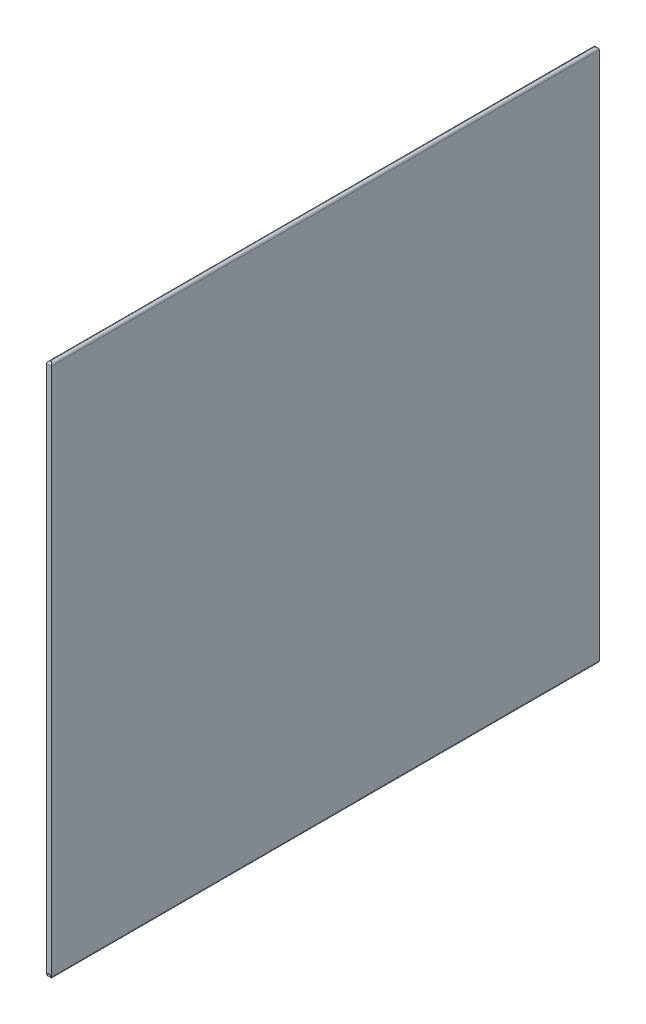
ISO-10303-21;
HEADER;
FILE_DESCRIPTION(('STEP AP214'),'2;1');
FILE_NAME('part.step','',(''),(''),'','','');
FILE_SCHEMA(('AUTOMOTIVE_DESIGN { 1 0 10303 214 1 1 1 1 }'));
ENDSEC;
DATA;
#1=APPLICATION_CONTEXT('core data for automotive mechanical design processes');
#2=APPLICATION_PROTOCOL_DEFINITION('international standard','automotive_design',2000,#1);
#3=PRODUCT_CONTEXT('',#1,'mechanical');
#4=PRODUCT('Part','Part','',(#3));
#5=PRODUCT_RELATED_PRODUCT_CATEGORY('part','',(#4));
#6=PRODUCT_DEFINITION_FORMATION('','',#4);
#7=PRODUCT_DEFINITION_CONTEXT('part definition',#1,'design');
#8=PRODUCT_DEFINITION('design','',#6,#7);
#9=PRODUCT_DEFINITION_SHAPE('','',#8);
#10=(LENGTH_UNIT() NAMED_UNIT(*) SI_UNIT(.MILLI.,.METRE.));
#11=(NAMED_UNIT(*) PLANE_ANGLE_UNIT() SI_UNIT($,.RADIAN.));
#12=(NAMED_UNIT(*) SI_UNIT($,.STERADIAN.) SOLID_ANGLE_UNIT());
#13=UNCERTAINTY_MEASURE_WITH_UNIT(LENGTH_MEASURE(1.E-05),#10,'distance_accuracy_value','');
#14=(GEOMETRIC_REPRESENTATION_CONTEXT(3) GLOBAL_UNCERTAINTY_ASSIGNED_CONTEXT((#13)) GLOBAL_UNIT_ASSIGNED_CONTEXT((#10,
#11,#12)) REPRESENTATION_CONTEXT('',''));
#15=CARTESIAN_POINT('',(0.,0.,0.));
#16=DIRECTION('',(0.,0.,1.));
#17=DIRECTION('',(1.,0.,0.));
#18=AXIS2_PLACEMENT_3D('',#15,#16,#17);
#19=CARTESIAN_POINT('',(3.,167.,-171.5));
#20=DIRECTION('',(0.,0.,1.));
#21=DIRECTION('',(0.,-1.,0.));
#22=AXIS2_PLACEMENT_3D('',#19,#20,#21);
#23=PLANE('',#22);
#24=DIRECTION('',(0.,1.,0.));
#25=VECTOR('',#24,1.);
#26=CARTESIAN_POINT('',(0.,167.,-171.5));
#27=LINE('',#26,#25);
#28=CARTESIAN_POINT('',(0.,-165.5,-171.5));
#29=VERTEX_POINT('',#28);
#30=CARTESIAN_POINT('',(0.,165.5,-171.5));
#31=VERTEX_POINT('',#30);
#32=EDGE_CURVE('E95',#29,#31,#27,.T.);
#33=ORIENTED_EDGE('',*,*,#32,.T.);
#34=DIRECTION('',(-1.,0.,0.));
#35=VECTOR('',#34,1.);
#36=CARTESIAN_POINT('',(3.,165.5,-171.5));
#37=LINE('',#36,#35);
#38=CARTESIAN_POINT('',(3.,165.5,-171.5));
#39=VERTEX_POINT('',#38);
#40=EDGE_CURVE('E103',#31,#39,#37,.F.);
#41=ORIENTED_EDGE('',*,*,#40,.T.);
#42=DIRECTION('',(0.,1.,0.));
#43=VECTOR('',#42,1.);
#44=CARTESIAN_POINT('',(3.,167.,-171.5));
#45=LINE('',#44,#43);
#46=CARTESIAN_POINT('',(3.,-165.5,-171.5));
#47=VERTEX_POINT('',#46);
#48=EDGE_CURVE('E151',#47,#39,#45,.T.);
#49=ORIENTED_EDGE('',*,*,#48,.F.);
#50=DIRECTION('',(-1.,0.,0.));
#51=VECTOR('',#50,1.);
#52=CARTESIAN_POINT('',(3.,-165.5,-171.5));
#53=LINE('',#52,#51);
#54=CARTESIAN_POINT('',(2.5,-165.5,-171.5));
#55=VERTEX_POINT('',#54);
#56=EDGE_CURVE('E317',#47,#55,#53,.T.);
#57=ORIENTED_EDGE('',*,*,#56,.T.);
#58=CARTESIAN_POINT('',(1.5,-165.5,-171.5));
#59=DIRECTION('',(0.,0.,1.));
#60=DIRECTION('',(1.,0.,0.));
#61=AXIS2_PLACEMENT_3D('',#58,#59,#60);
#62=CIRCLE('',#61,1.);
#63=CARTESIAN_POINT('',(0.5,-165.5,-171.5));
#64=VERTEX_POINT('',#63);
#65=EDGE_CURVE('E108',#55,#64,#62,.T.);
#66=ORIENTED_EDGE('',*,*,#65,.T.);
#67=DIRECTION('',(-1.,0.,0.));
#68=VECTOR('',#67,1.);
#69=CARTESIAN_POINT('',(3.,-165.5,-171.5));
#70=LINE('',#69,#68);
#71=EDGE_CURVE('E107',#64,#29,#70,.T.);
#72=ORIENTED_EDGE('',*,*,#71,.T.);
#73=EDGE_LOOP('',(#33,#41,#49,#57,#66,#72));
#74=FACE_BOUND('',#73,.T.);
#75=ADVANCED_FACE('F34',(#74),#23,.F.);
#76=CARTESIAN_POINT('',(3.,167.,171.5));
#77=DIRECTION('',(0.,0.,-1.));
#78=DIRECTION('',(0.,1.,0.));
#79=AXIS2_PLACEMENT_3D('',#76,#77,#78);
#80=PLANE('',#79);
#81=DIRECTION('',(0.,-1.,0.));
#82=VECTOR('',#81,1.);
#83=CARTESIAN_POINT('',(3.,167.,171.5));
#84=LINE('',#83,#82);
#85=CARTESIAN_POINT('',(3.,165.5,171.5));
#86=VERTEX_POINT('',#85);
#87=CARTESIAN_POINT('',(3.,-165.5,171.5));
#88=VERTEX_POINT('',#87);
#89=EDGE_CURVE('E149',#86,#88,#84,.T.);
#90=ORIENTED_EDGE('',*,*,#89,.F.);
#91=DIRECTION('',(-1.,0.,0.));
#92=VECTOR('',#91,1.);
#93=CARTESIAN_POINT('',(3.,165.5,171.5));
#94=LINE('',#93,#92);
#95=CARTESIAN_POINT('',(0.,165.5,171.5));
#96=VERTEX_POINT('',#95);
#97=EDGE_CURVE('E44',#86,#96,#94,.T.);
#98=ORIENTED_EDGE('',*,*,#97,.T.);
#99=DIRECTION('',(0.,-1.,0.));
#100=VECTOR('',#99,1.);
#101=CARTESIAN_POINT('',(0.,167.,171.5));
#102=LINE('',#101,#100);
#103=CARTESIAN_POINT('',(0.,-165.5,171.5));
#104=VERTEX_POINT('',#103);
#105=EDGE_CURVE('E97',#96,#104,#102,.T.);
#106=ORIENTED_EDGE('',*,*,#105,.T.);
#107=DIRECTION('',(-1.,0.,0.));
#108=VECTOR('',#107,1.);
#109=CARTESIAN_POINT('',(3.,-165.5,171.5));
#110=LINE('',#109,#108);
#111=CARTESIAN_POINT('',(0.5,-165.5,171.5));
#112=VERTEX_POINT('',#111);
#113=EDGE_CURVE('E310',#104,#112,#110,.F.);
#114=ORIENTED_EDGE('',*,*,#113,.T.);
#115=CARTESIAN_POINT('',(1.5,-165.5,171.5));
#116=DIRECTION('',(0.,0.,1.));
#117=DIRECTION('',(1.,0.,0.));
#118=AXIS2_PLACEMENT_3D('',#115,#116,#117);
#119=CIRCLE('',#118,1.);
#120=CARTESIAN_POINT('',(2.5,-165.5,171.5));
#121=VERTEX_POINT('',#120);
#122=EDGE_CURVE('E142',#121,#112,#119,.T.);
#123=ORIENTED_EDGE('',*,*,#122,.F.);
#124=DIRECTION('',(-1.,0.,0.));
#125=VECTOR('',#124,1.);
#126=CARTESIAN_POINT('',(3.,-165.5,171.5));
#127=LINE('',#126,#125);
#128=EDGE_CURVE('E155',#121,#88,#127,.F.);
#129=ORIENTED_EDGE('',*,*,#128,.T.);
#130=EDGE_LOOP('',(#90,#98,#106,#114,#123,#129));
#131=FACE_BOUND('',#130,.T.);
#132=ADVANCED_FACE('F152',(#131),#80,.F.);
#133=CARTESIAN_POINT('',(3.,-167.,-171.5));
#134=DIRECTION('',(1.,0.,0.));
#135=DIRECTION('',(0.,0.,-1.));
#136=AXIS2_PLACEMENT_3D('',#133,#134,#135);
#137=PLANE('',#136);
#138=ORIENTED_EDGE('',*,*,#48,.T.);
#139=DIRECTION('',(0.,0.,1.));
#140=VECTOR('',#139,1.);
#141=CARTESIAN_POINT('',(3.,165.5,171.5));
#142=LINE('',#141,#140);
#143=EDGE_CURVE('E116',#39,#86,#142,.T.);
#144=ORIENTED_EDGE('',*,*,#143,.T.);
#145=ORIENTED_EDGE('',*,*,#89,.T.);
#146=DIRECTION('',(0.,0.,-1.));
#147=VECTOR('',#146,1.);
#148=CARTESIAN_POINT('',(3.,-165.5,-171.5));
#149=LINE('',#148,#147);
#150=EDGE_CURVE('E186',#88,#47,#149,.T.);
#151=ORIENTED_EDGE('',*,*,#150,.T.);
#152=EDGE_LOOP('',(#138,#144,#145,#151));
#153=FACE_BOUND('',#152,.T.);
#154=ADVANCED_FACE('F146',(#153),#137,.T.);
#155=CARTESIAN_POINT('',(0.,-167.,-171.5));
#156=DIRECTION('',(1.,0.,0.));
#157=DIRECTION('',(0.,0.,-1.));
#158=AXIS2_PLACEMENT_3D('',#155,#156,#157);
#159=PLANE('',#158);
#160=ORIENTED_EDGE('',*,*,#105,.F.);
#161=DIRECTION('',(0.,0.,1.));
#162=VECTOR('',#161,1.);
#163=CARTESIAN_POINT('',(0.,165.5,-171.5));
#164=LINE('',#163,#162);
#165=EDGE_CURVE('E11',#96,#31,#164,.F.);
#166=ORIENTED_EDGE('',*,*,#165,.T.);
#167=ORIENTED_EDGE('',*,*,#32,.F.);
#168=DIRECTION('',(0.,0.,-1.));
#169=VECTOR('',#168,1.);
#170=CARTESIAN_POINT('',(0.,-165.5,-171.5));
#171=LINE('',#170,#169);
#172=EDGE_CURVE('E117',#29,#104,#171,.F.);
#173=ORIENTED_EDGE('',*,*,#172,.T.);
#174=EDGE_LOOP('',(#160,#166,#167,#173));
#175=FACE_BOUND('',#174,.T.);
#176=ADVANCED_FACE('F93',(#175),#159,.F.);
#177=CARTESIAN_POINT('',(1.5,-165.5,-171.5));
#178=DIRECTION('',(0.,0.,1.));
#179=DIRECTION('',(1.,0.,0.));
#180=AXIS2_PLACEMENT_3D('',#177,#178,#179);
#181=CYLINDRICAL_SURFACE('',#180,1.);
#182=ORIENTED_EDGE('',*,*,#65,.F.);
#183=CARTESIAN_POINT('',(2.5,-165.5,-171.5));
#184=CARTESIAN_POINT('',(2.50000213248189,-165.525222990855,-171.500003070334));
#185=CARTESIAN_POINT('',(2.49904499371486,-165.550431776475,-171.499363152648));
#186=CARTESIAN_POINT('',(2.49524199874773,-165.600629112911,-171.496831201766));
#187=CARTESIAN_POINT('',(2.4923972154442,-165.625617780667,-171.494939879844));
#188=CARTESIAN_POINT('',(2.48112709883325,-165.699663245567,-171.48747331579));
#189=CARTESIAN_POINT('',(2.4699650315194,-165.748156182402,-171.480104466037));
#190=CARTESIAN_POINT('',(2.44095418700605,-165.842087599947,-171.461257846778));
#191=CARTESIAN_POINT('',(2.42311782994395,-165.887531570356,-171.449787711075));
#192=CARTESIAN_POINT('',(2.38149564691459,-165.974657625672,-171.423647481404));
#193=CARTESIAN_POINT('',(2.35770218136297,-166.016334785768,-171.408973281556));
#194=CARTESIAN_POINT('',(2.30266965775545,-166.098645812887,-171.3761355465));
#195=CARTESIAN_POINT('',(2.27097200165984,-166.138895498828,-171.35778213569));
#196=CARTESIAN_POINT('',(2.20213023620311,-166.213868266687,-171.319909073444));
#197=CARTESIAN_POINT('',(2.16497900858315,-166.248583999983,-171.30038791785));
#198=CARTESIAN_POINT('',(2.07947349446955,-166.317111807446,-171.258641166792));
#199=CARTESIAN_POINT('',(2.03027648073668,-166.349916409879,-171.236475027298));
#200=CARTESIAN_POINT('',(1.9258175326236,-166.40675210789,-171.195420470658));
#201=CARTESIAN_POINT('',(1.87056639195628,-166.430798497502,-171.176526370281));
#202=CARTESIAN_POINT('',(1.77164456216695,-166.463370108933,-171.149881389324));
#203=CARTESIAN_POINT('',(1.72923620443698,-166.47437212537,-171.140488234465));
#204=CARTESIAN_POINT('',(1.64262819626992,-166.490753033265,-171.126289897628));
#205=CARTESIAN_POINT('',(1.59843175121121,-166.49614156076,-171.121476854726));
#206=CARTESIAN_POINT('',(1.50926261471987,-166.500956820802,-171.117183028096));
#207=CARTESIAN_POINT('',(1.46428749714002,-166.500359214949,-171.117724012648));
#208=CARTESIAN_POINT('',(1.3751825221893,-166.49318790774,-171.124098876286));
#209=CARTESIAN_POINT('',(1.33105341345558,-166.486609142232,-171.12993724057));
#210=CARTESIAN_POINT('',(1.24676627768333,-166.468324929029,-171.145635966616));
#211=CARTESIAN_POINT('',(1.20651894747408,-166.456858450018,-171.155307534178));
#212=CARTESIAN_POINT('',(1.12848779270318,-166.429350437143,-171.177548234967));
#213=CARTESIAN_POINT('',(1.09070476004808,-166.413307441421,-171.190118293802));
#214=CARTESIAN_POINT('',(1.01048753786344,-166.373369220774,-171.219820894925));
#215=CARTESIAN_POINT('',(0.96867050096613,-166.348540569392,-171.237361400579));
#216=CARTESIAN_POINT('',(0.889308701198348,-166.293345085664,-171.273457490993));
#217=CARTESIAN_POINT('',(0.851769348144859,-166.262971364212,-171.292014318113));
#218=CARTESIAN_POINT('',(0.773731920925005,-166.18990899484,-171.332715056892));
#219=CARTESIAN_POINT('',(0.734338884622625,-166.14597700278,-171.354770433332));
#220=CARTESIAN_POINT('',(0.663406423713538,-166.051010849238,-171.396087632438));
#221=CARTESIAN_POINT('',(0.631860807189989,-165.999982337071,-171.415351652548));
#222=CARTESIAN_POINT('',(0.583246943501984,-165.902402495506,-171.445735942707));
#223=CARTESIAN_POINT('',(0.564554000713006,-165.856926569714,-171.45771205485));
#224=CARTESIAN_POINT('',(0.533931258474159,-165.762945787397,-171.477549146516));
#225=CARTESIAN_POINT('',(0.521986900799653,-165.714447703419,-171.485418981378));
#226=CARTESIAN_POINT('',(0.509176214174973,-165.637947419418,-171.493894598437));
#227=CARTESIAN_POINT('',(0.505743657680969,-165.610532328099,-171.496175478036));
#228=CARTESIAN_POINT('',(0.501153051464654,-165.555417283018,-171.499231127029));
#229=CARTESIAN_POINT('',(0.499996031208196,-165.527717206022,-171.50000521474));
#230=CARTESIAN_POINT('',(0.5,-165.5,-171.5));
#231=B_SPLINE_CURVE_WITH_KNOTS('',3,(#183,#184,#185,#186,#187,#188,#189,#190,#191,#192,#193,
#194,#195,#196,#197,#198,#199,#200,#201,#202,#203,#204,#205,#206,#207,#208,#209,#210,#211,#212,
#213,#214,#215,#216,#217,#218,#219,#220,#221,#222,#223,#224,#225,#226,#227,#228,#229,#230),
.UNSPECIFIED.,.F.,.F.,(4,2,2,2,2,2,2,2,2,2,2,2,2,2,2,2,2,2,2,2,2,2,2,4),(0.,0.0756155393796863,
0.151188137283899,0.301278773145161,0.451091484295527,0.601097313024787,0.763749621108001,
0.92661615014031,1.11518883123062,1.30343062019747,1.43732188431412,1.57098293189719,
1.7051876379853,1.83950607898824,1.96789901619187,2.09633301145898,2.25089113961453,
2.40564261145954,2.59373489293892,2.7816782882283,2.93287425225033,3.08374279470931,
3.16678966855171,3.24987410464917),.UNSPECIFIED.);
#232=EDGE_CURVE('E187',#55,#64,#231,.T.);
#233=ORIENTED_EDGE('',*,*,#232,.T.);
#234=EDGE_LOOP('',(#182,#233));
#235=FACE_BOUND('',#234,.T.);
#236=ORIENTED_EDGE('',*,*,#122,.T.);
#237=CARTESIAN_POINT('',(0.5,-165.5,171.5));
#238=CARTESIAN_POINT('',(0.499997867518114,-165.525222990855,171.500003070334));
#239=CARTESIAN_POINT('',(0.500955006285137,-165.550431776475,171.499363152648));
#240=CARTESIAN_POINT('',(0.504758001252271,-165.600629112911,171.496831201766));
#241=CARTESIAN_POINT('',(0.507602784555795,-165.625617780667,171.494939879844));
#242=CARTESIAN_POINT('',(0.518872901166755,-165.699663245567,171.48747331579));
#243=CARTESIAN_POINT('',(0.530034968480598,-165.748156182402,171.480104466037));
#244=CARTESIAN_POINT('',(0.559045812993951,-165.842087599947,171.461257846777));
#245=CARTESIAN_POINT('',(0.576882170056055,-165.887531570356,171.449787711075));
#246=CARTESIAN_POINT('',(0.618504353085416,-165.974657625672,171.423647481404));
#247=CARTESIAN_POINT('',(0.642297818637035,-166.016334785768,171.408973281555));
#248=CARTESIAN_POINT('',(0.697330342244554,-166.098645812887,171.3761355465));
#249=CARTESIAN_POINT('',(0.729027998340174,-166.138895498828,171.35778213569));
#250=CARTESIAN_POINT('',(0.797869763796898,-166.213868266687,171.319909073444));
#251=CARTESIAN_POINT('',(0.835020991416855,-166.248583999983,171.30038791785));
#252=CARTESIAN_POINT('',(0.920526505530444,-166.317111807446,171.258641166792));
#253=CARTESIAN_POINT('',(0.969723519263316,-166.349916409879,171.236475027298));
#254=CARTESIAN_POINT('',(1.0741824673764,-166.40675210789,171.195420470658));
#255=CARTESIAN_POINT('',(1.12943360804372,-166.430798497502,171.17652637028));
#256=CARTESIAN_POINT('',(1.22835543783305,-166.463370108933,171.149881389324));
#257=CARTESIAN_POINT('',(1.27076379556302,-166.47437212537,171.140488234465));
#258=CARTESIAN_POINT('',(1.35737180373009,-166.490753033265,171.126289897628));
#259=CARTESIAN_POINT('',(1.40156824878879,-166.49614156076,171.121476854726));
#260=CARTESIAN_POINT('',(1.49073738528013,-166.500956820802,171.117183028096));
#261=CARTESIAN_POINT('',(1.53571250285998,-166.500359214949,171.117724012648));
#262=CARTESIAN_POINT('',(1.6248174778107,-166.49318790774,171.124098876286));
#263=CARTESIAN_POINT('',(1.66894658654442,-166.486609142232,171.12993724057));
#264=CARTESIAN_POINT('',(1.75323372231667,-166.468324929029,171.145635966616));
#265=CARTESIAN_POINT('',(1.79348105252592,-166.456858450018,171.155307534177));
#266=CARTESIAN_POINT('',(1.87151220729682,-166.429350437143,171.177548234967));
#267=CARTESIAN_POINT('',(1.90929523995193,-166.413307441421,171.190118293802));
#268=CARTESIAN_POINT('',(1.98951246213657,-166.373369220774,171.219820894925));
#269=CARTESIAN_POINT('',(2.03132949903387,-166.348540569392,171.237361400579));
#270=CARTESIAN_POINT('',(2.11069129880165,-166.293345085664,171.273457490993));
#271=CARTESIAN_POINT('',(2.14823065185514,-166.262971364212,171.292014318113));
#272=CARTESIAN_POINT('',(2.226268079075,-166.18990899484,171.332715056892));
#273=CARTESIAN_POINT('',(2.26566111537738,-166.14597700278,171.354770433332));
#274=CARTESIAN_POINT('',(2.33659357628646,-166.051010849238,171.396087632438));
#275=CARTESIAN_POINT('',(2.36813919281001,-165.999982337071,171.415351652548));
#276=CARTESIAN_POINT('',(2.41675305649801,-165.902402495506,171.445735942706));
#277=CARTESIAN_POINT('',(2.43544599928699,-165.856926569715,171.45771205485));
#278=CARTESIAN_POINT('',(2.46606874152584,-165.762945787397,171.477549146516));
#279=CARTESIAN_POINT('',(2.47801309920035,-165.714447703419,171.485418981378));
#280=CARTESIAN_POINT('',(2.49082378582503,-165.637947419418,171.493894598437));
#281=CARTESIAN_POINT('',(2.49425634231903,-165.610532328099,171.496175478036));
#282=CARTESIAN_POINT('',(2.49884694853535,-165.555417283018,171.499231127029));
#283=CARTESIAN_POINT('',(2.5000039687918,-165.527717206022,171.50000521474));
#284=CARTESIAN_POINT('',(2.5,-165.5,171.5));
#285=B_SPLINE_CURVE_WITH_KNOTS('',3,(#237,#238,#239,#240,#241,#242,#243,#244,#245,#246,#247,
#248,#249,#250,#251,#252,#253,#254,#255,#256,#257,#258,#259,#260,#261,#262,#263,#264,#265,#266,
#267,#268,#269,#270,#271,#272,#273,#274,#275,#276,#277,#278,#279,#280,#281,#282,#283,#284),
.UNSPECIFIED.,.F.,.F.,(4,2,2,2,2,2,2,2,2,2,2,2,2,2,2,2,2,2,2,2,2,2,2,4),(0.,0.0756155393796585,
0.151188137283899,0.301278773145161,0.451091484295534,0.601097313024785,0.763749621108006,
0.926616150140306,1.11518883123062,1.30343062019747,1.43732188431411,1.57098293189719,
1.70518763798529,1.83950607898823,1.96789901619187,2.09633301145897,2.25089113961454,
2.40564261145954,2.59373489293892,2.78167828822829,2.9328742522503,3.08374279470931,
3.16678966855171,3.24987410464917),.UNSPECIFIED.);
#286=EDGE_CURVE('E178',#112,#121,#285,.T.);
#287=ORIENTED_EDGE('',*,*,#286,.T.);
#288=EDGE_LOOP('',(#236,#287));
#289=FACE_BOUND('',#288,.T.);
#290=ADVANCED_FACE('F194',(#235,#289),#181,.F.);
#291=CARTESIAN_POINT('',(3.,-165.5,-170.));
#292=DIRECTION('',(-1.,0.,0.));
#293=DIRECTION('',(0.,0.,1.));
#294=AXIS2_PLACEMENT_3D('',#291,#292,#293);
#295=CYLINDRICAL_SURFACE('',#294,1.5);
#296=ORIENTED_EDGE('',*,*,#232,.F.);
#297=ORIENTED_EDGE('',*,*,#56,.F.);
#298=CARTESIAN_POINT('',(1.5,-165.5,-170.));
#299=DIRECTION('',(-0.707106781186547,0.,-0.707106781186547));
#300=DIRECTION('',(-0.707106781186547,0.,0.707106781186547));
#301=AXIS2_PLACEMENT_3D('',#298,#299,#300);
#302=ELLIPSE('',#301,2.12132034355964,1.5);
#303=CARTESIAN_POINT('',(1.5,-167.,-170.));
#304=VERTEX_POINT('',#303);
#305=EDGE_CURVE('E140',#304,#47,#302,.F.);
#306=ORIENTED_EDGE('',*,*,#305,.F.);
#307=CARTESIAN_POINT('',(1.5,-165.5,-170.));
#308=DIRECTION('',(0.707106781186547,0.,-0.707106781186547));
#309=DIRECTION('',(-0.707106781186547,0.,-0.707106781186547));
#310=AXIS2_PLACEMENT_3D('',#307,#308,#309);
#311=ELLIPSE('',#310,2.12132034355964,1.5);
#312=EDGE_CURVE('E133',#29,#304,#311,.F.);
#313=ORIENTED_EDGE('',*,*,#312,.F.);
#314=ORIENTED_EDGE('',*,*,#71,.F.);
#315=EDGE_LOOP('',(#296,#297,#306,#313,#314));
#316=FACE_BOUND('',#315,.T.);
#317=ADVANCED_FACE('F198',(#316),#295,.T.);
#318=CARTESIAN_POINT('',(1.5,-165.5,-171.5));
#319=DIRECTION('',(0.,0.,1.));
#320=DIRECTION('',(1.,0.,0.));
#321=AXIS2_PLACEMENT_3D('',#318,#319,#320);
#322=CYLINDRICAL_SURFACE('',#321,1.5);
#323=DIRECTION('',(0.,0.,-1.));
#324=VECTOR('',#323,1.);
#325=CARTESIAN_POINT('',(1.5,-167.,171.5));
#326=LINE('',#325,#324);
#327=CARTESIAN_POINT('',(1.5,-167.,170.));
#328=VERTEX_POINT('',#327);
#329=EDGE_CURVE('E78',#304,#328,#326,.F.);
#330=ORIENTED_EDGE('',*,*,#329,.F.);
#331=ORIENTED_EDGE('',*,*,#305,.T.);
#332=ORIENTED_EDGE('',*,*,#150,.F.);
#333=CARTESIAN_POINT('',(1.5,-165.5,170.));
#334=DIRECTION('',(-0.707106781186547,0.,0.707106781186547));
#335=DIRECTION('',(0.707106781186547,0.,0.707106781186547));
#336=AXIS2_PLACEMENT_3D('',#333,#334,#335);
#337=ELLIPSE('',#336,2.12132034355964,1.5);
#338=EDGE_CURVE('E128',#328,#88,#337,.T.);
#339=ORIENTED_EDGE('',*,*,#338,.F.);
#340=EDGE_LOOP('',(#330,#331,#332,#339));
#341=FACE_BOUND('',#340,.T.);
#342=ADVANCED_FACE('F217',(#341),#322,.T.);
#343=CARTESIAN_POINT('',(1.5,-165.5,171.5));
#344=DIRECTION('',(0.,0.,-1.));
#345=DIRECTION('',(-1.,0.,0.));
#346=AXIS2_PLACEMENT_3D('',#343,#344,#345);
#347=CYLINDRICAL_SURFACE('',#346,1.5);
#348=ORIENTED_EDGE('',*,*,#312,.T.);
#349=ORIENTED_EDGE('',*,*,#329,.T.);
#350=CARTESIAN_POINT('',(1.5,-165.5,170.));
#351=DIRECTION('',(-0.707106781186547,0.,-0.707106781186547));
#352=DIRECTION('',(0.707106781186547,0.,-0.707106781186547));
#353=AXIS2_PLACEMENT_3D('',#350,#351,#352);
#354=ELLIPSE('',#353,2.12132034355964,1.5);
#355=EDGE_CURVE('E125',#104,#328,#354,.F.);
#356=ORIENTED_EDGE('',*,*,#355,.F.);
#357=ORIENTED_EDGE('',*,*,#172,.F.);
#358=EDGE_LOOP('',(#348,#349,#356,#357));
#359=FACE_BOUND('',#358,.T.);
#360=ADVANCED_FACE('F165',(#359),#347,.T.);
#361=CARTESIAN_POINT('',(3.,-165.5,170.));
#362=DIRECTION('',(-1.,0.,0.));
#363=DIRECTION('',(0.,0.,1.));
#364=AXIS2_PLACEMENT_3D('',#361,#362,#363);
#365=CYLINDRICAL_SURFACE('',#364,1.5);
#366=ORIENTED_EDGE('',*,*,#286,.F.);
#367=ORIENTED_EDGE('',*,*,#113,.F.);
#368=ORIENTED_EDGE('',*,*,#355,.T.);
#369=ORIENTED_EDGE('',*,*,#338,.T.);
#370=ORIENTED_EDGE('',*,*,#128,.F.);
#371=EDGE_LOOP('',(#366,#367,#368,#369,#370));
#372=FACE_BOUND('',#371,.T.);
#373=ADVANCED_FACE('F160',(#372),#365,.T.);
#374=CARTESIAN_POINT('',(3.,165.5,170.));
#375=DIRECTION('',(-1.,0.,0.));
#376=DIRECTION('',(0.,0.,1.));
#377=AXIS2_PLACEMENT_3D('',#374,#375,#376);
#378=CYLINDRICAL_SURFACE('',#377,1.5);
#379=CARTESIAN_POINT('',(1.5,165.5,170.));
#380=DIRECTION('',(0.707106781186547,0.,0.707106781186547));
#381=DIRECTION('',(-0.707106781186547,0.,0.707106781186547));
#382=AXIS2_PLACEMENT_3D('',#379,#380,#381);
#383=ELLIPSE('',#382,2.12132034355964,1.5);
#384=CARTESIAN_POINT('',(1.5,167.,170.));
#385=VERTEX_POINT('',#384);
#386=EDGE_CURVE('E121',#96,#385,#383,.F.);
#387=ORIENTED_EDGE('',*,*,#386,.F.);
#388=ORIENTED_EDGE('',*,*,#97,.F.);
#389=CARTESIAN_POINT('',(1.5,165.5,170.));
#390=DIRECTION('',(-0.707106781186547,0.,0.707106781186547));
#391=DIRECTION('',(-0.707106781186547,0.,-0.707106781186547));
#392=AXIS2_PLACEMENT_3D('',#389,#390,#391);
#393=ELLIPSE('',#392,2.12132034355964,1.5);
#394=EDGE_CURVE('E38',#385,#86,#393,.F.);
#395=ORIENTED_EDGE('',*,*,#394,.F.);
#396=EDGE_LOOP('',(#387,#388,#395));
#397=FACE_BOUND('',#396,.T.);
#398=ADVANCED_FACE('F36',(#397),#378,.T.);
#399=CARTESIAN_POINT('',(1.5,165.5,-171.5));
#400=DIRECTION('',(0.,0.,-1.));
#401=DIRECTION('',(-1.,0.,0.));
#402=AXIS2_PLACEMENT_3D('',#399,#400,#401);
#403=CYLINDRICAL_SURFACE('',#402,1.5);
#404=DIRECTION('',(0.,0.,1.));
#405=VECTOR('',#404,1.);
#406=CARTESIAN_POINT('',(1.5,167.,-171.5));
#407=LINE('',#406,#405);
#408=CARTESIAN_POINT('',(1.5,167.,-170.));
#409=VERTEX_POINT('',#408);
#410=EDGE_CURVE('E64',#385,#409,#407,.F.);
#411=ORIENTED_EDGE('',*,*,#410,.F.);
#412=ORIENTED_EDGE('',*,*,#394,.T.);
#413=ORIENTED_EDGE('',*,*,#143,.F.);
#414=CARTESIAN_POINT('',(1.5,165.5,-170.));
#415=DIRECTION('',(-0.707106781186547,0.,-0.707106781186547));
#416=DIRECTION('',(0.707106781186547,0.,-0.707106781186547));
#417=AXIS2_PLACEMENT_3D('',#414,#415,#416);
#418=ELLIPSE('',#417,2.12132034355964,1.5);
#419=EDGE_CURVE('E114',#409,#39,#418,.T.);
#420=ORIENTED_EDGE('',*,*,#419,.F.);
#421=EDGE_LOOP('',(#411,#412,#413,#420));
#422=FACE_BOUND('',#421,.T.);
#423=ADVANCED_FACE('F159',(#422),#403,.T.);
#424=CARTESIAN_POINT('',(1.5,165.5,171.5));
#425=DIRECTION('',(0.,0.,1.));
#426=DIRECTION('',(1.,0.,0.));
#427=AXIS2_PLACEMENT_3D('',#424,#425,#426);
#428=CYLINDRICAL_SURFACE('',#427,1.5);
#429=ORIENTED_EDGE('',*,*,#386,.T.);
#430=ORIENTED_EDGE('',*,*,#410,.T.);
#431=CARTESIAN_POINT('',(1.5,165.5,-170.));
#432=DIRECTION('',(-0.707106781186547,0.,0.707106781186547));
#433=DIRECTION('',(0.707106781186547,0.,0.707106781186547));
#434=AXIS2_PLACEMENT_3D('',#431,#432,#433);
#435=ELLIPSE('',#434,2.12132034355964,1.5);
#436=EDGE_CURVE('E113',#31,#409,#435,.F.);
#437=ORIENTED_EDGE('',*,*,#436,.F.);
#438=ORIENTED_EDGE('',*,*,#165,.F.);
#439=EDGE_LOOP('',(#429,#430,#437,#438));
#440=FACE_BOUND('',#439,.T.);
#441=ADVANCED_FACE('F119',(#440),#428,.T.);
#442=CARTESIAN_POINT('',(3.,165.5,-170.));
#443=DIRECTION('',(-1.,0.,0.));
#444=DIRECTION('',(0.,0.,1.));
#445=AXIS2_PLACEMENT_3D('',#442,#443,#444);
#446=CYLINDRICAL_SURFACE('',#445,1.5);
#447=ORIENTED_EDGE('',*,*,#419,.T.);
#448=ORIENTED_EDGE('',*,*,#40,.F.);
#449=ORIENTED_EDGE('',*,*,#436,.T.);
#450=EDGE_LOOP('',(#447,#448,#449));
#451=FACE_BOUND('',#450,.T.);
#452=ADVANCED_FACE('F112',(#451),#446,.T.);
#453=CLOSED_SHELL('',(#75,#132,#154,#176,#290,#317,#342,#360,#373,#398,#423,#441,#452));
#454=MANIFOLD_SOLID_BREP('B2',#453);
#455=ADVANCED_BREP_SHAPE_REPRESENTATION('',(#18,#454),#14);
#456=SHAPE_DEFINITION_REPRESENTATION(#9,#455);
ENDSEC;
END-ISO-10303-21;
